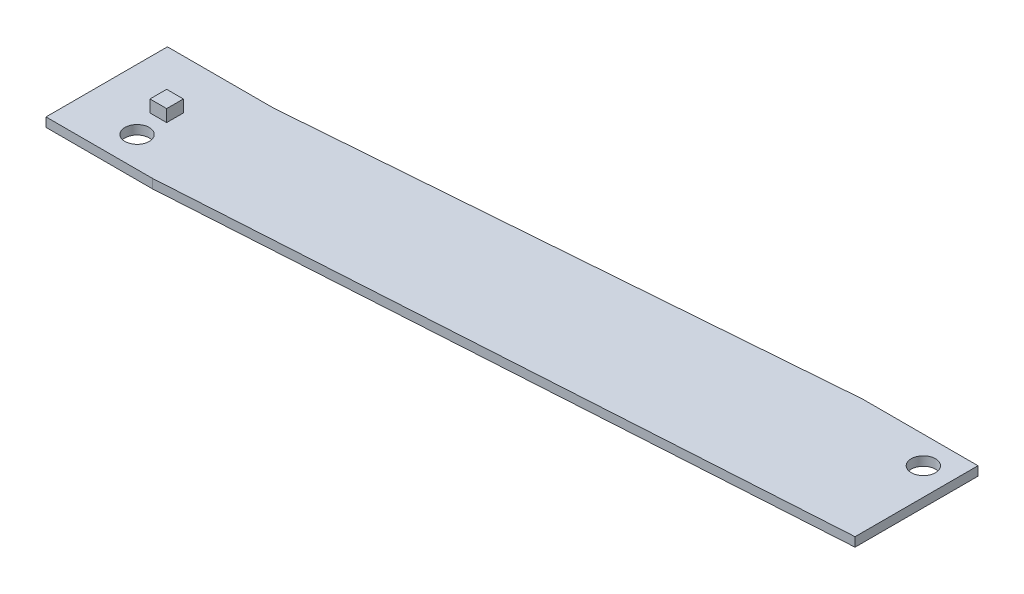
ISO-10303-21;
HEADER;
FILE_DESCRIPTION(('STEP AP214'),'2;1');
FILE_NAME('part.step','',(''),(''),'','','');
FILE_SCHEMA(('AUTOMOTIVE_DESIGN { 1 0 10303 214 1 1 1 1 }'));
ENDSEC;
DATA;
#1=APPLICATION_CONTEXT('core data for automotive mechanical design processes');
#2=APPLICATION_PROTOCOL_DEFINITION('international standard','automotive_design',2000,#1);
#3=PRODUCT_CONTEXT('',#1,'mechanical');
#4=PRODUCT('Part','Part','',(#3));
#5=PRODUCT_RELATED_PRODUCT_CATEGORY('part','',(#4));
#6=PRODUCT_DEFINITION_FORMATION('','',#4);
#7=PRODUCT_DEFINITION_CONTEXT('part definition',#1,'design');
#8=PRODUCT_DEFINITION('design','',#6,#7);
#9=PRODUCT_DEFINITION_SHAPE('','',#8);
#10=(LENGTH_UNIT() NAMED_UNIT(*) SI_UNIT(.MILLI.,.METRE.));
#11=(NAMED_UNIT(*) PLANE_ANGLE_UNIT() SI_UNIT($,.RADIAN.));
#12=(NAMED_UNIT(*) SI_UNIT($,.STERADIAN.) SOLID_ANGLE_UNIT());
#13=UNCERTAINTY_MEASURE_WITH_UNIT(LENGTH_MEASURE(1.E-05),#10,'distance_accuracy_value','');
#14=(GEOMETRIC_REPRESENTATION_CONTEXT(3) GLOBAL_UNCERTAINTY_ASSIGNED_CONTEXT((#13)) GLOBAL_UNIT_ASSIGNED_CONTEXT((#10,
#11,#12)) REPRESENTATION_CONTEXT('',''));
#15=CARTESIAN_POINT('',(0.,0.,0.));
#16=DIRECTION('',(0.,0.,1.));
#17=DIRECTION('',(1.,0.,0.));
#18=AXIS2_PLACEMENT_3D('',#15,#16,#17);
#19=CARTESIAN_POINT('',(0.,1.2,0.));
#20=DIRECTION('',(0.,-1.,0.));
#21=DIRECTION('',(0.,0.,-1.));
#22=AXIS2_PLACEMENT_3D('',#19,#20,#21);
#23=PLANE('',#22);
#24=DIRECTION('',(0.,0.,-1.));
#25=VECTOR('',#24,1.);
#26=CARTESIAN_POINT('',(87.2,1.2,-5.60000000000004));
#27=LINE('',#26,#25);
#28=CARTESIAN_POINT('',(87.2,1.2,10.6));
#29=VERTEX_POINT('',#28);
#30=CARTESIAN_POINT('',(87.2,1.2,-5.60000000000004));
#31=VERTEX_POINT('',#30);
#32=EDGE_CURVE('E176',#29,#31,#27,.T.);
#33=ORIENTED_EDGE('',*,*,#32,.T.);
#34=DIRECTION('',(-1.,0.,0.));
#35=VECTOR('',#34,1.);
#36=CARTESIAN_POINT('',(87.2,1.2,-5.60000000000004));
#37=LINE('',#36,#35);
#38=CARTESIAN_POINT('',(72.,1.2,-5.60000000000004));
#39=VERTEX_POINT('',#38);
#40=EDGE_CURVE('E180',#31,#39,#37,.T.);
#41=ORIENTED_EDGE('',*,*,#40,.T.);
#42=DIRECTION('',(-0.996988962962474,0.,0.077543586008193));
#43=VECTOR('',#42,1.);
#44=CARTESIAN_POINT('',(0.,1.2,0.));
#45=LINE('',#44,#43);
#46=CARTESIAN_POINT('',(0.,1.2,0.));
#47=VERTEX_POINT('',#46);
#48=EDGE_CURVE('E184',#39,#47,#45,.T.);
#49=ORIENTED_EDGE('',*,*,#48,.T.);
#50=DIRECTION('',(-1.,0.,0.));
#51=VECTOR('',#50,1.);
#52=CARTESIAN_POINT('',(0.,1.2,0.));
#53=LINE('',#52,#51);
#54=CARTESIAN_POINT('',(-14.,1.2,0.));
#55=VERTEX_POINT('',#54);
#56=EDGE_CURVE('E187',#47,#55,#53,.T.);
#57=ORIENTED_EDGE('',*,*,#56,.T.);
#58=DIRECTION('',(0.,0.,1.));
#59=VECTOR('',#58,1.);
#60=CARTESIAN_POINT('',(-14.,1.2,0.));
#61=LINE('',#60,#59);
#62=CARTESIAN_POINT('',(-14.,1.2,16.));
#63=VERTEX_POINT('',#62);
#64=EDGE_CURVE('E190',#55,#63,#61,.T.);
#65=ORIENTED_EDGE('',*,*,#64,.T.);
#66=DIRECTION('',(1.,0.,0.));
#67=VECTOR('',#66,1.);
#68=CARTESIAN_POINT('',(0.,1.2,16.));
#69=LINE('',#68,#67);
#70=CARTESIAN_POINT('',(0.,1.2,16.));
#71=VERTEX_POINT('',#70);
#72=EDGE_CURVE('E193',#63,#71,#69,.T.);
#73=ORIENTED_EDGE('',*,*,#72,.T.);
#74=DIRECTION('',(0.998088045134511,0.,-0.0618082046298897));
#75=VECTOR('',#74,1.);
#76=CARTESIAN_POINT('',(87.2,1.2,10.6));
#77=LINE('',#76,#75);
#78=EDGE_CURVE('E196',#71,#29,#77,.T.);
#79=ORIENTED_EDGE('',*,*,#78,.T.);
#80=EDGE_LOOP('',(#33,#41,#49,#57,#65,#73,#79));
#81=FACE_BOUND('',#80,.T.);
#82=CARTESIAN_POINT('',(83.6,1.2,-2.00000000000004));
#83=DIRECTION('',(0.,1.,0.));
#84=DIRECTION('',(0.,0.,1.));
#85=AXIS2_PLACEMENT_3D('',#82,#83,#84);
#86=CIRCLE('',#85,1.60000000000001);
#87=CARTESIAN_POINT('',(83.6,1.2,-0.400000000000036));
#88=VERTEX_POINT('',#87);
#89=EDGE_CURVE('E158',#88,#88,#86,.T.);
#90=ORIENTED_EDGE('',*,*,#89,.F.);
#91=EDGE_LOOP('',(#90));
#92=FACE_BOUND('',#91,.T.);
#93=CARTESIAN_POINT('',(-6.,1.2,12.));
#94=DIRECTION('',(0.,1.,0.));
#95=DIRECTION('',(0.,0.,1.));
#96=AXIS2_PLACEMENT_3D('',#93,#94,#95);
#97=CIRCLE('',#96,1.6);
#98=CARTESIAN_POINT('',(-6.,1.2,13.6));
#99=VERTEX_POINT('',#98);
#100=EDGE_CURVE('E164',#99,#99,#97,.T.);
#101=ORIENTED_EDGE('',*,*,#100,.F.);
#102=EDGE_LOOP('',(#101));
#103=FACE_BOUND('',#102,.T.);
#104=DIRECTION('',(0.,0.,1.));
#105=VECTOR('',#104,1.);
#106=CARTESIAN_POINT('',(-7.6,1.2,6.5));
#107=LINE('',#106,#105);
#108=CARTESIAN_POINT('',(-7.6,1.2,6.5));
#109=VERTEX_POINT('',#108);
#110=CARTESIAN_POINT('',(-7.6,1.2,8.7));
#111=VERTEX_POINT('',#110);
#112=EDGE_CURVE('E151',#109,#111,#107,.T.);
#113=ORIENTED_EDGE('',*,*,#112,.F.);
#114=DIRECTION('',(-1.,0.,0.));
#115=VECTOR('',#114,1.);
#116=CARTESIAN_POINT('',(-7.6,1.2,6.5));
#117=LINE('',#116,#115);
#118=CARTESIAN_POINT('',(-5.4,1.2,6.5));
#119=VERTEX_POINT('',#118);
#120=EDGE_CURVE('E148',#119,#109,#117,.T.);
#121=ORIENTED_EDGE('',*,*,#120,.F.);
#122=DIRECTION('',(0.,0.,-1.));
#123=VECTOR('',#122,1.);
#124=CARTESIAN_POINT('',(-5.4,1.2,6.5));
#125=LINE('',#124,#123);
#126=CARTESIAN_POINT('',(-5.4,1.2,8.7));
#127=VERTEX_POINT('',#126);
#128=EDGE_CURVE('E66',#127,#119,#125,.T.);
#129=ORIENTED_EDGE('',*,*,#128,.F.);
#130=DIRECTION('',(1.,0.,0.));
#131=VECTOR('',#130,1.);
#132=CARTESIAN_POINT('',(-7.6,1.2,8.7));
#133=LINE('',#132,#131);
#134=EDGE_CURVE('E61',#111,#127,#133,.T.);
#135=ORIENTED_EDGE('',*,*,#134,.F.);
#136=EDGE_LOOP('',(#113,#121,#129,#135));
#137=FACE_BOUND('',#136,.T.);
#138=ADVANCED_FACE('F45',(#81,#92,#103,#137),#23,.F.);
#139=CARTESIAN_POINT('',(87.2,1.2,-5.60000000000004));
#140=DIRECTION('',(-1.,0.,0.));
#141=DIRECTION('',(0.,0.,1.));
#142=AXIS2_PLACEMENT_3D('',#139,#140,#141);
#143=PLANE('',#142);
#144=DIRECTION('',(0.,0.,-1.));
#145=VECTOR('',#144,1.);
#146=CARTESIAN_POINT('',(87.2,0.,-5.60000000000004));
#147=LINE('',#146,#145);
#148=CARTESIAN_POINT('',(87.2,0.,10.6));
#149=VERTEX_POINT('',#148);
#150=CARTESIAN_POINT('',(87.2,0.,-5.60000000000004));
#151=VERTEX_POINT('',#150);
#152=EDGE_CURVE('E171',#149,#151,#147,.T.);
#153=ORIENTED_EDGE('',*,*,#152,.T.);
#154=DIRECTION('',(0.,-1.,0.));
#155=VECTOR('',#154,1.);
#156=CARTESIAN_POINT('',(87.2,1.2,-5.60000000000004));
#157=LINE('',#156,#155);
#158=EDGE_CURVE('E11',#31,#151,#157,.T.);
#159=ORIENTED_EDGE('',*,*,#158,.F.);
#160=ORIENTED_EDGE('',*,*,#32,.F.);
#161=DIRECTION('',(0.,-1.,0.));
#162=VECTOR('',#161,1.);
#163=CARTESIAN_POINT('',(87.2,1.2,10.6));
#164=LINE('',#163,#162);
#165=EDGE_CURVE('E199',#29,#149,#164,.T.);
#166=ORIENTED_EDGE('',*,*,#165,.T.);
#167=EDGE_LOOP('',(#153,#159,#160,#166));
#168=FACE_BOUND('',#167,.T.);
#169=ADVANCED_FACE('F47',(#168),#143,.F.);
#170=CARTESIAN_POINT('',(87.2,1.2,-5.60000000000004));
#171=DIRECTION('',(0.,0.,1.));
#172=DIRECTION('',(1.,0.,0.));
#173=AXIS2_PLACEMENT_3D('',#170,#171,#172);
#174=PLANE('',#173);
#175=DIRECTION('',(-1.,0.,0.));
#176=VECTOR('',#175,1.);
#177=CARTESIAN_POINT('',(87.2,0.,-5.60000000000004));
#178=LINE('',#177,#176);
#179=CARTESIAN_POINT('',(72.,0.,-5.60000000000004));
#180=VERTEX_POINT('',#179);
#181=EDGE_CURVE('E203',#151,#180,#178,.T.);
#182=ORIENTED_EDGE('',*,*,#181,.T.);
#183=DIRECTION('',(0.,-1.,0.));
#184=VECTOR('',#183,1.);
#185=CARTESIAN_POINT('',(72.,1.2,-5.60000000000004));
#186=LINE('',#185,#184);
#187=EDGE_CURVE('E54',#39,#180,#186,.T.);
#188=ORIENTED_EDGE('',*,*,#187,.F.);
#189=ORIENTED_EDGE('',*,*,#40,.F.);
#190=ORIENTED_EDGE('',*,*,#158,.T.);
#191=EDGE_LOOP('',(#182,#188,#189,#190));
#192=FACE_BOUND('',#191,.T.);
#193=ADVANCED_FACE('F267',(#192),#174,.F.);
#194=CARTESIAN_POINT('',(0.,1.2,0.));
#195=DIRECTION('',(0.077543586008193,0.,0.996988962962474));
#196=DIRECTION('',(0.996988962962475,0.,-0.077543586008193));
#197=AXIS2_PLACEMENT_3D('',#194,#195,#196);
#198=PLANE('',#197);
#199=DIRECTION('',(-0.996988962962474,0.,0.077543586008193));
#200=VECTOR('',#199,1.);
#201=CARTESIAN_POINT('',(0.,0.,0.));
#202=LINE('',#201,#200);
#203=CARTESIAN_POINT('',(0.,0.,0.));
#204=VERTEX_POINT('',#203);
#205=EDGE_CURVE('E206',#180,#204,#202,.T.);
#206=ORIENTED_EDGE('',*,*,#205,.T.);
#207=DIRECTION('',(0.,-1.,0.));
#208=VECTOR('',#207,1.);
#209=CARTESIAN_POINT('',(0.,1.2,0.));
#210=LINE('',#209,#208);
#211=EDGE_CURVE('E235',#47,#204,#210,.T.);
#212=ORIENTED_EDGE('',*,*,#211,.F.);
#213=ORIENTED_EDGE('',*,*,#48,.F.);
#214=ORIENTED_EDGE('',*,*,#187,.T.);
#215=EDGE_LOOP('',(#206,#212,#213,#214));
#216=FACE_BOUND('',#215,.T.);
#217=ADVANCED_FACE('F244',(#216),#198,.F.);
#218=CARTESIAN_POINT('',(0.,1.2,0.));
#219=DIRECTION('',(0.,0.,1.));
#220=DIRECTION('',(1.,0.,0.));
#221=AXIS2_PLACEMENT_3D('',#218,#219,#220);
#222=PLANE('',#221);
#223=DIRECTION('',(-1.,0.,0.));
#224=VECTOR('',#223,1.);
#225=CARTESIAN_POINT('',(0.,0.,0.));
#226=LINE('',#225,#224);
#227=CARTESIAN_POINT('',(-14.,0.,0.));
#228=VERTEX_POINT('',#227);
#229=EDGE_CURVE('E209',#204,#228,#226,.T.);
#230=ORIENTED_EDGE('',*,*,#229,.T.);
#231=DIRECTION('',(0.,-1.,0.));
#232=VECTOR('',#231,1.);
#233=CARTESIAN_POINT('',(-14.,1.2,0.));
#234=LINE('',#233,#232);
#235=EDGE_CURVE('E231',#55,#228,#234,.T.);
#236=ORIENTED_EDGE('',*,*,#235,.F.);
#237=ORIENTED_EDGE('',*,*,#56,.F.);
#238=ORIENTED_EDGE('',*,*,#211,.T.);
#239=EDGE_LOOP('',(#230,#236,#237,#238));
#240=FACE_BOUND('',#239,.T.);
#241=ADVANCED_FACE('F255',(#240),#222,.F.);
#242=CARTESIAN_POINT('',(-14.,1.2,0.));
#243=DIRECTION('',(1.,0.,0.));
#244=DIRECTION('',(0.,0.,-1.));
#245=AXIS2_PLACEMENT_3D('',#242,#243,#244);
#246=PLANE('',#245);
#247=DIRECTION('',(0.,0.,1.));
#248=VECTOR('',#247,1.);
#249=CARTESIAN_POINT('',(-14.,0.,0.));
#250=LINE('',#249,#248);
#251=CARTESIAN_POINT('',(-14.,0.,16.));
#252=VERTEX_POINT('',#251);
#253=EDGE_CURVE('E212',#228,#252,#250,.T.);
#254=ORIENTED_EDGE('',*,*,#253,.T.);
#255=DIRECTION('',(0.,-1.,0.));
#256=VECTOR('',#255,1.);
#257=CARTESIAN_POINT('',(-14.,1.2,16.));
#258=LINE('',#257,#256);
#259=EDGE_CURVE('E227',#63,#252,#258,.T.);
#260=ORIENTED_EDGE('',*,*,#259,.F.);
#261=ORIENTED_EDGE('',*,*,#64,.F.);
#262=ORIENTED_EDGE('',*,*,#235,.T.);
#263=EDGE_LOOP('',(#254,#260,#261,#262));
#264=FACE_BOUND('',#263,.T.);
#265=ADVANCED_FACE('F259',(#264),#246,.F.);
#266=CARTESIAN_POINT('',(0.,1.2,16.));
#267=DIRECTION('',(0.,0.,-1.));
#268=DIRECTION('',(-1.,0.,0.));
#269=AXIS2_PLACEMENT_3D('',#266,#267,#268);
#270=PLANE('',#269);
#271=DIRECTION('',(1.,0.,0.));
#272=VECTOR('',#271,1.);
#273=CARTESIAN_POINT('',(0.,0.,16.));
#274=LINE('',#273,#272);
#275=CARTESIAN_POINT('',(0.,0.,16.));
#276=VERTEX_POINT('',#275);
#277=EDGE_CURVE('E215',#252,#276,#274,.T.);
#278=ORIENTED_EDGE('',*,*,#277,.T.);
#279=DIRECTION('',(0.,-1.,0.));
#280=VECTOR('',#279,1.);
#281=CARTESIAN_POINT('',(0.,1.2,16.));
#282=LINE('',#281,#280);
#283=EDGE_CURVE('E223',#71,#276,#282,.T.);
#284=ORIENTED_EDGE('',*,*,#283,.F.);
#285=ORIENTED_EDGE('',*,*,#72,.F.);
#286=ORIENTED_EDGE('',*,*,#259,.T.);
#287=EDGE_LOOP('',(#278,#284,#285,#286));
#288=FACE_BOUND('',#287,.T.);
#289=ADVANCED_FACE('F275',(#288),#270,.F.);
#290=CARTESIAN_POINT('',(87.2,1.2,10.6));
#291=DIRECTION('',(-0.0618082046298897,0.,-0.998088045134511));
#292=DIRECTION('',(-0.998088045134511,0.,0.0618082046298897));
#293=AXIS2_PLACEMENT_3D('',#290,#291,#292);
#294=PLANE('',#293);
#295=DIRECTION('',(0.998088045134511,0.,-0.0618082046298897));
#296=VECTOR('',#295,1.);
#297=CARTESIAN_POINT('',(87.2,0.,10.6));
#298=LINE('',#297,#296);
#299=EDGE_CURVE('E181',#276,#149,#298,.T.);
#300=ORIENTED_EDGE('',*,*,#299,.T.);
#301=ORIENTED_EDGE('',*,*,#165,.F.);
#302=ORIENTED_EDGE('',*,*,#78,.F.);
#303=ORIENTED_EDGE('',*,*,#283,.T.);
#304=EDGE_LOOP('',(#300,#301,#302,#303));
#305=FACE_BOUND('',#304,.T.);
#306=ADVANCED_FACE('F272',(#305),#294,.F.);
#307=CARTESIAN_POINT('',(0.,0.,0.));
#308=DIRECTION('',(0.,-1.,0.));
#309=DIRECTION('',(0.,0.,-1.));
#310=AXIS2_PLACEMENT_3D('',#307,#308,#309);
#311=PLANE('',#310);
#312=CARTESIAN_POINT('',(-6.,0.,12.));
#313=DIRECTION('',(0.,-1.,0.));
#314=DIRECTION('',(0.,0.,-1.));
#315=AXIS2_PLACEMENT_3D('',#312,#313,#314);
#316=CIRCLE('',#315,1.6);
#317=CARTESIAN_POINT('',(-6.,0.,10.4));
#318=VERTEX_POINT('',#317);
#319=EDGE_CURVE('E168',#318,#318,#316,.F.);
#320=ORIENTED_EDGE('',*,*,#319,.T.);
#321=EDGE_LOOP('',(#320));
#322=FACE_BOUND('',#321,.T.);
#323=CARTESIAN_POINT('',(83.6,0.,-2.00000000000004));
#324=DIRECTION('',(0.,-1.,0.));
#325=DIRECTION('',(0.,0.,-1.));
#326=AXIS2_PLACEMENT_3D('',#323,#324,#325);
#327=CIRCLE('',#326,1.60000000000001);
#328=CARTESIAN_POINT('',(83.6,0.,-3.60000000000005));
#329=VERTEX_POINT('',#328);
#330=EDGE_CURVE('E153',#329,#329,#327,.F.);
#331=ORIENTED_EDGE('',*,*,#330,.T.);
#332=EDGE_LOOP('',(#331));
#333=FACE_BOUND('',#332,.T.);
#334=ORIENTED_EDGE('',*,*,#152,.F.);
#335=ORIENTED_EDGE('',*,*,#299,.F.);
#336=ORIENTED_EDGE('',*,*,#277,.F.);
#337=ORIENTED_EDGE('',*,*,#253,.F.);
#338=ORIENTED_EDGE('',*,*,#229,.F.);
#339=ORIENTED_EDGE('',*,*,#205,.F.);
#340=ORIENTED_EDGE('',*,*,#181,.F.);
#341=EDGE_LOOP('',(#334,#335,#336,#337,#338,#339,#340));
#342=FACE_BOUND('',#341,.T.);
#343=ADVANCED_FACE('F250',(#322,#333,#342),#311,.T.);
#344=CARTESIAN_POINT('',(83.6,-4.52548339959392,-2.00000000000004));
#345=DIRECTION('',(0.,1.,0.));
#346=DIRECTION('',(0.,0.,1.));
#347=AXIS2_PLACEMENT_3D('',#344,#345,#346);
#348=CYLINDRICAL_SURFACE('',#347,1.60000000000001);
#349=ORIENTED_EDGE('',*,*,#89,.T.);
#350=EDGE_LOOP('',(#349));
#351=FACE_BOUND('',#350,.T.);
#352=ORIENTED_EDGE('',*,*,#330,.F.);
#353=EDGE_LOOP('',(#352));
#354=FACE_BOUND('',#353,.T.);
#355=ADVANCED_FACE('F293',(#351,#354),#348,.F.);
#356=CARTESIAN_POINT('',(-6.,-4.52548339959392,12.));
#357=DIRECTION('',(0.,1.,0.));
#358=DIRECTION('',(0.,0.,1.));
#359=AXIS2_PLACEMENT_3D('',#356,#357,#358);
#360=CYLINDRICAL_SURFACE('',#359,1.6);
#361=ORIENTED_EDGE('',*,*,#100,.T.);
#362=EDGE_LOOP('',(#361));
#363=FACE_BOUND('',#362,.T.);
#364=ORIENTED_EDGE('',*,*,#319,.F.);
#365=EDGE_LOOP('',(#364));
#366=FACE_BOUND('',#365,.T.);
#367=ADVANCED_FACE('F300',(#363,#366),#360,.F.);
#368=CARTESIAN_POINT('',(-7.6,2.8,6.5));
#369=DIRECTION('',(1.,0.,0.));
#370=DIRECTION('',(0.,0.,-1.));
#371=AXIS2_PLACEMENT_3D('',#368,#369,#370);
#372=PLANE('',#371);
#373=ORIENTED_EDGE('',*,*,#112,.T.);
#374=DIRECTION('',(0.,-1.,0.));
#375=VECTOR('',#374,1.);
#376=CARTESIAN_POINT('',(-7.6,2.8,8.7));
#377=LINE('',#376,#375);
#378=CARTESIAN_POINT('',(-7.6,2.8,8.7));
#379=VERTEX_POINT('',#378);
#380=EDGE_CURVE('E130',#379,#111,#377,.T.);
#381=ORIENTED_EDGE('',*,*,#380,.F.);
#382=DIRECTION('',(0.,0.,1.));
#383=VECTOR('',#382,1.);
#384=CARTESIAN_POINT('',(-7.6,2.8,6.5));
#385=LINE('',#384,#383);
#386=CARTESIAN_POINT('',(-7.6,2.8,6.5));
#387=VERTEX_POINT('',#386);
#388=EDGE_CURVE('E138',#387,#379,#385,.T.);
#389=ORIENTED_EDGE('',*,*,#388,.F.);
#390=DIRECTION('',(0.,-1.,0.));
#391=VECTOR('',#390,1.);
#392=CARTESIAN_POINT('',(-7.6,2.8,6.5));
#393=LINE('',#392,#391);
#394=EDGE_CURVE('E418',#387,#109,#393,.T.);
#395=ORIENTED_EDGE('',*,*,#394,.T.);
#396=EDGE_LOOP('',(#373,#381,#389,#395));
#397=FACE_BOUND('',#396,.T.);
#398=ADVANCED_FACE('F150',(#397),#372,.F.);
#399=CARTESIAN_POINT('',(-7.6,2.8,8.7));
#400=DIRECTION('',(0.,0.,-1.));
#401=DIRECTION('',(-1.,0.,0.));
#402=AXIS2_PLACEMENT_3D('',#399,#400,#401);
#403=PLANE('',#402);
#404=ORIENTED_EDGE('',*,*,#134,.T.);
#405=DIRECTION('',(0.,-1.,0.));
#406=VECTOR('',#405,1.);
#407=CARTESIAN_POINT('',(-5.4,2.8,8.7));
#408=LINE('',#407,#406);
#409=CARTESIAN_POINT('',(-5.4,2.8,8.7));
#410=VERTEX_POINT('',#409);
#411=EDGE_CURVE('E133',#410,#127,#408,.T.);
#412=ORIENTED_EDGE('',*,*,#411,.F.);
#413=DIRECTION('',(1.,0.,0.));
#414=VECTOR('',#413,1.);
#415=CARTESIAN_POINT('',(-7.6,2.8,8.7));
#416=LINE('',#415,#414);
#417=EDGE_CURVE('E126',#379,#410,#416,.T.);
#418=ORIENTED_EDGE('',*,*,#417,.F.);
#419=ORIENTED_EDGE('',*,*,#380,.T.);
#420=EDGE_LOOP('',(#404,#412,#418,#419));
#421=FACE_BOUND('',#420,.T.);
#422=ADVANCED_FACE('F128',(#421),#403,.F.);
#423=CARTESIAN_POINT('',(-5.4,2.8,6.5));
#424=DIRECTION('',(-1.,0.,0.));
#425=DIRECTION('',(0.,0.,1.));
#426=AXIS2_PLACEMENT_3D('',#423,#424,#425);
#427=PLANE('',#426);
#428=ORIENTED_EDGE('',*,*,#128,.T.);
#429=DIRECTION('',(0.,-1.,0.));
#430=VECTOR('',#429,1.);
#431=CARTESIAN_POINT('',(-5.4,2.8,6.5));
#432=LINE('',#431,#430);
#433=CARTESIAN_POINT('',(-5.4,2.8,6.5));
#434=VERTEX_POINT('',#433);
#435=EDGE_CURVE('E160',#434,#119,#432,.T.);
#436=ORIENTED_EDGE('',*,*,#435,.F.);
#437=DIRECTION('',(0.,0.,-1.));
#438=VECTOR('',#437,1.);
#439=CARTESIAN_POINT('',(-5.4,2.8,6.5));
#440=LINE('',#439,#438);
#441=EDGE_CURVE('E137',#410,#434,#440,.T.);
#442=ORIENTED_EDGE('',*,*,#441,.F.);
#443=ORIENTED_EDGE('',*,*,#411,.T.);
#444=EDGE_LOOP('',(#428,#436,#442,#443));
#445=FACE_BOUND('',#444,.T.);
#446=ADVANCED_FACE('F314',(#445),#427,.F.);
#447=CARTESIAN_POINT('',(-7.6,2.8,6.5));
#448=DIRECTION('',(0.,0.,1.));
#449=DIRECTION('',(1.,0.,0.));
#450=AXIS2_PLACEMENT_3D('',#447,#448,#449);
#451=PLANE('',#450);
#452=ORIENTED_EDGE('',*,*,#120,.T.);
#453=ORIENTED_EDGE('',*,*,#394,.F.);
#454=DIRECTION('',(-1.,0.,0.));
#455=VECTOR('',#454,1.);
#456=CARTESIAN_POINT('',(-7.6,2.8,6.5));
#457=LINE('',#456,#455);
#458=EDGE_CURVE('E143',#434,#387,#457,.T.);
#459=ORIENTED_EDGE('',*,*,#458,.F.);
#460=ORIENTED_EDGE('',*,*,#435,.T.);
#461=EDGE_LOOP('',(#452,#453,#459,#460));
#462=FACE_BOUND('',#461,.T.);
#463=ADVANCED_FACE('F317',(#462),#451,.F.);
#464=CARTESIAN_POINT('',(0.,2.8,0.));
#465=DIRECTION('',(0.,1.,0.));
#466=DIRECTION('',(0.,0.,1.));
#467=AXIS2_PLACEMENT_3D('',#464,#465,#466);
#468=PLANE('',#467);
#469=ORIENTED_EDGE('',*,*,#388,.T.);
#470=ORIENTED_EDGE('',*,*,#417,.T.);
#471=ORIENTED_EDGE('',*,*,#441,.T.);
#472=ORIENTED_EDGE('',*,*,#458,.T.);
#473=EDGE_LOOP('',(#469,#470,#471,#472));
#474=FACE_BOUND('',#473,.T.);
#475=ADVANCED_FACE('F141',(#474),#468,.T.);
#476=CLOSED_SHELL('',(#138,#169,#193,#217,#241,#265,#289,#306,#343,#355,#367,#398,#422,#446,
#463,#475));
#477=MANIFOLD_SOLID_BREP('B2',#476);
#478=ADVANCED_BREP_SHAPE_REPRESENTATION('',(#18,#477),#14);
#479=SHAPE_DEFINITION_REPRESENTATION(#9,#478);
ENDSEC;
END-ISO-10303-21;
